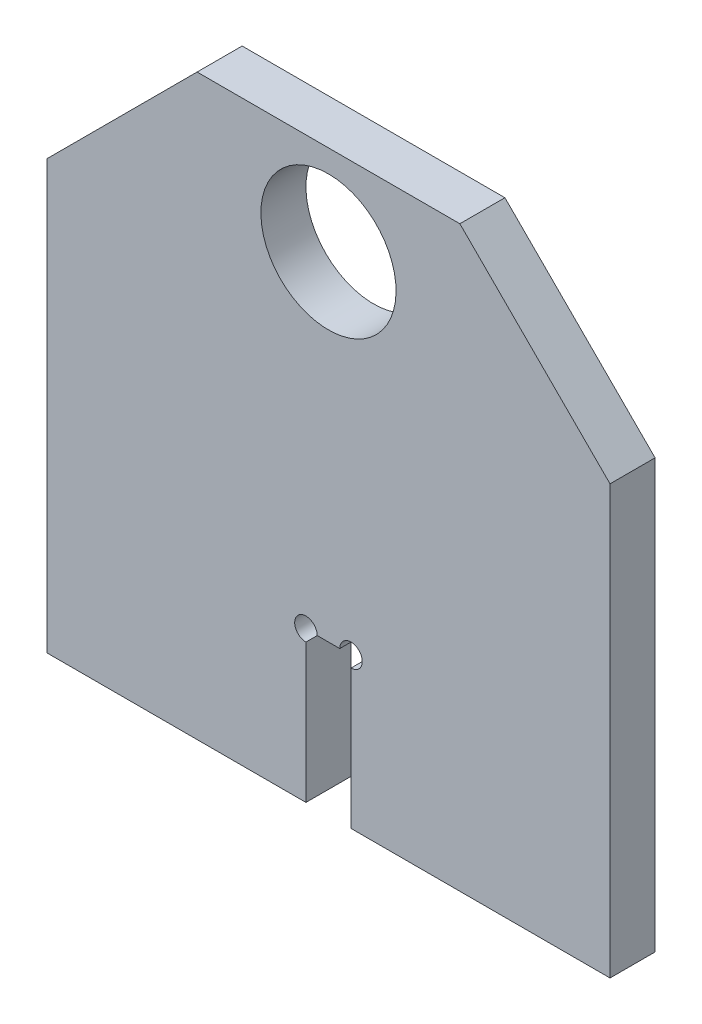
ISO-10303-21;
HEADER;
FILE_DESCRIPTION(('STEP AP214'),'2;1');
FILE_NAME('part.step','',(''),(''),'','','');
FILE_SCHEMA(('AUTOMOTIVE_DESIGN { 1 0 10303 214 1 1 1 1 }'));
ENDSEC;
DATA;
#1=APPLICATION_CONTEXT('core data for automotive mechanical design processes');
#2=APPLICATION_PROTOCOL_DEFINITION('international standard','automotive_design',2000,#1);
#3=PRODUCT_CONTEXT('',#1,'mechanical');
#4=PRODUCT('Part','Part','',(#3));
#5=PRODUCT_RELATED_PRODUCT_CATEGORY('part','',(#4));
#6=PRODUCT_DEFINITION_FORMATION('','',#4);
#7=PRODUCT_DEFINITION_CONTEXT('part definition',#1,'design');
#8=PRODUCT_DEFINITION('design','',#6,#7);
#9=PRODUCT_DEFINITION_SHAPE('','',#8);
#10=(LENGTH_UNIT() NAMED_UNIT(*) SI_UNIT(.MILLI.,.METRE.));
#11=(NAMED_UNIT(*) PLANE_ANGLE_UNIT() SI_UNIT($,.RADIAN.));
#12=(NAMED_UNIT(*) SI_UNIT($,.STERADIAN.) SOLID_ANGLE_UNIT());
#13=UNCERTAINTY_MEASURE_WITH_UNIT(LENGTH_MEASURE(1.E-05),#10,'distance_accuracy_value','');
#14=(GEOMETRIC_REPRESENTATION_CONTEXT(3) GLOBAL_UNCERTAINTY_ASSIGNED_CONTEXT((#13)) GLOBAL_UNIT_ASSIGNED_CONTEXT((#10,
#11,#12)) REPRESENTATION_CONTEXT('',''));
#15=CARTESIAN_POINT('',(0.,0.,0.));
#16=DIRECTION('',(0.,0.,1.));
#17=DIRECTION('',(1.,0.,0.));
#18=AXIS2_PLACEMENT_3D('',#15,#16,#17);
#19=CARTESIAN_POINT('',(3.00000000000011,120.,113.489534374282));
#20=DIRECTION('',(0.,0.,-1.));
#21=DIRECTION('',(-1.,0.,0.));
#22=AXIS2_PLACEMENT_3D('',#19,#20,#21);
#23=CYLINDRICAL_SURFACE('',#22,1.5);
#24=CARTESIAN_POINT('',(3.00000000000011,120.,6.00000000000001));
#25=DIRECTION('',(0.,0.,-1.));
#26=DIRECTION('',(0.,1.,0.));
#27=AXIS2_PLACEMENT_3D('',#24,#25,#26);
#28=CIRCLE('',#27,1.5);
#29=CARTESIAN_POINT('',(1.50000000000011,120.,6.00000000000001));
#30=VERTEX_POINT('',#29);
#31=CARTESIAN_POINT('',(3.00000000000013,118.5,6.00000000000001));
#32=VERTEX_POINT('',#31);
#33=EDGE_CURVE('E188',#30,#32,#28,.T.);
#34=ORIENTED_EDGE('',*,*,#33,.F.);
#35=DIRECTION('',(0.,0.,-1.));
#36=VECTOR('',#35,1.);
#37=CARTESIAN_POINT('',(1.50000000000011,120.,113.489534374282));
#38=LINE('',#37,#36);
#39=CARTESIAN_POINT('',(1.50000000000011,120.,0.));
#40=VERTEX_POINT('',#39);
#41=EDGE_CURVE('E145',#30,#40,#38,.T.);
#42=ORIENTED_EDGE('',*,*,#41,.T.);
#43=CARTESIAN_POINT('',(3.00000000000011,120.,0.));
#44=DIRECTION('',(0.,0.,1.));
#45=DIRECTION('',(1.,0.,0.));
#46=AXIS2_PLACEMENT_3D('',#43,#44,#45);
#47=CIRCLE('',#46,1.5);
#48=CARTESIAN_POINT('',(3.00000000000013,118.5,0.));
#49=VERTEX_POINT('',#48);
#50=EDGE_CURVE('E139',#49,#40,#47,.T.);
#51=ORIENTED_EDGE('',*,*,#50,.F.);
#52=DIRECTION('',(0.,0.,-1.));
#53=VECTOR('',#52,1.);
#54=CARTESIAN_POINT('',(3.00000000000013,118.5,113.489534374282));
#55=LINE('',#54,#53);
#56=EDGE_CURVE('E125',#32,#49,#55,.T.);
#57=ORIENTED_EDGE('',*,*,#56,.F.);
#58=EDGE_LOOP('',(#34,#42,#51,#57));
#59=FACE_BOUND('',#58,.T.);
#60=ADVANCED_FACE('F34',(#59),#23,.F.);
#61=CARTESIAN_POINT('',(3.00000000000165,0.,113.489534374282));
#62=DIRECTION('',(1.,0.,0.));
#63=DIRECTION('',(0.,1.,0.));
#64=AXIS2_PLACEMENT_3D('',#61,#62,#63);
#65=PLANE('',#64);
#66=DIRECTION('',(0.,0.,-1.));
#67=VECTOR('',#66,1.);
#68=CARTESIAN_POINT('',(3.00000000000037,99.9999999999999,113.489534374282));
#69=LINE('',#68,#67);
#70=CARTESIAN_POINT('',(3.00000000000037,99.9999999999999,6.00000000000001));
#71=VERTEX_POINT('',#70);
#72=CARTESIAN_POINT('',(3.00000000000037,99.9999999999999,0.));
#73=VERTEX_POINT('',#72);
#74=EDGE_CURVE('E119',#71,#73,#69,.T.);
#75=ORIENTED_EDGE('',*,*,#74,.F.);
#76=DIRECTION('',(0.,1.,0.));
#77=VECTOR('',#76,1.);
#78=CARTESIAN_POINT('',(3.00000000000165,0.,5.99999999999999));
#79=LINE('',#78,#77);
#80=EDGE_CURVE('E130',#71,#32,#79,.T.);
#81=ORIENTED_EDGE('',*,*,#80,.T.);
#82=ORIENTED_EDGE('',*,*,#56,.T.);
#83=DIRECTION('',(0.,-1.,0.));
#84=VECTOR('',#83,1.);
#85=CARTESIAN_POINT('',(3.00000000000165,0.,0.));
#86=LINE('',#85,#84);
#87=EDGE_CURVE('E128',#49,#73,#86,.T.);
#88=ORIENTED_EDGE('',*,*,#87,.T.);
#89=EDGE_LOOP('',(#75,#81,#82,#88));
#90=FACE_BOUND('',#89,.T.);
#91=ADVANCED_FACE('F127',(#90),#65,.F.);
#92=CARTESIAN_POINT('',(0.,99.9999999999999,113.489534374282));
#93=DIRECTION('',(0.,1.,0.));
#94=DIRECTION('',(-1.,0.,0.));
#95=AXIS2_PLACEMENT_3D('',#92,#93,#94);
#96=PLANE('',#95);
#97=DIRECTION('',(0.,0.,-1.));
#98=VECTOR('',#97,1.);
#99=CARTESIAN_POINT('',(37.5,100.,113.489534374282));
#100=LINE('',#99,#98);
#101=CARTESIAN_POINT('',(37.5,100.,6.));
#102=VERTEX_POINT('',#101);
#103=CARTESIAN_POINT('',(37.5,100.,0.));
#104=VERTEX_POINT('',#103);
#105=EDGE_CURVE('E158',#102,#104,#100,.T.);
#106=ORIENTED_EDGE('',*,*,#105,.F.);
#107=DIRECTION('',(-1.,0.,0.));
#108=VECTOR('',#107,1.);
#109=CARTESIAN_POINT('',(0.,99.9999999999999,6.00000000000001));
#110=LINE('',#109,#108);
#111=EDGE_CURVE('E142',#102,#71,#110,.T.);
#112=ORIENTED_EDGE('',*,*,#111,.T.);
#113=ORIENTED_EDGE('',*,*,#74,.T.);
#114=DIRECTION('',(1.,0.,0.));
#115=VECTOR('',#114,1.);
#116=CARTESIAN_POINT('',(0.,99.9999999999999,0.));
#117=LINE('',#116,#115);
#118=EDGE_CURVE('E141',#73,#104,#117,.T.);
#119=ORIENTED_EDGE('',*,*,#118,.T.);
#120=EDGE_LOOP('',(#106,#112,#113,#119));
#121=FACE_BOUND('',#120,.T.);
#122=ADVANCED_FACE('F235',(#121),#96,.F.);
#123=CARTESIAN_POINT('',(37.4999999999998,0.,113.489534374282));
#124=DIRECTION('',(-1.,0.,0.));
#125=DIRECTION('',(0.,-1.,0.));
#126=AXIS2_PLACEMENT_3D('',#123,#124,#125);
#127=PLANE('',#126);
#128=DIRECTION('',(0.,0.,-1.));
#129=VECTOR('',#128,1.);
#130=CARTESIAN_POINT('',(37.5000000000001,157.,113.489534374282));
#131=LINE('',#130,#129);
#132=CARTESIAN_POINT('',(37.5000000000001,157.,6.00000000000002));
#133=VERTEX_POINT('',#132);
#134=CARTESIAN_POINT('',(37.5000000000001,157.,0.));
#135=VERTEX_POINT('',#134);
#136=EDGE_CURVE('E162',#133,#135,#131,.T.);
#137=ORIENTED_EDGE('',*,*,#136,.F.);
#138=DIRECTION('',(0.,-1.,0.));
#139=VECTOR('',#138,1.);
#140=CARTESIAN_POINT('',(37.4999999999998,0.,5.99999999999999));
#141=LINE('',#140,#139);
#142=EDGE_CURVE('E161',#133,#102,#141,.T.);
#143=ORIENTED_EDGE('',*,*,#142,.T.);
#144=ORIENTED_EDGE('',*,*,#105,.T.);
#145=DIRECTION('',(0.,1.,0.));
#146=VECTOR('',#145,1.);
#147=CARTESIAN_POINT('',(37.4999999999998,0.,0.));
#148=LINE('',#147,#146);
#149=EDGE_CURVE('E160',#104,#135,#148,.T.);
#150=ORIENTED_EDGE('',*,*,#149,.T.);
#151=EDGE_LOOP('',(#137,#143,#144,#150));
#152=FACE_BOUND('',#151,.T.);
#153=ADVANCED_FACE('F240',(#152),#127,.F.);
#154=CARTESIAN_POINT('',(97.25,97.2500000000001,113.489534374282));
#155=DIRECTION('',(-0.707106781186547,-0.707106781186548,0.));
#156=DIRECTION('',(0.707106781186548,-0.707106781186547,0.));
#157=AXIS2_PLACEMENT_3D('',#154,#155,#156);
#158=PLANE('',#157);
#159=DIRECTION('',(0.,0.,-1.));
#160=VECTOR('',#159,1.);
#161=CARTESIAN_POINT('',(17.5000000000001,177.,113.489534374282));
#162=LINE('',#161,#160);
#163=CARTESIAN_POINT('',(17.5000000000001,177.,6.00000000000002));
#164=VERTEX_POINT('',#163);
#165=CARTESIAN_POINT('',(17.5000000000001,177.,0.));
#166=VERTEX_POINT('',#165);
#167=EDGE_CURVE('E166',#164,#166,#162,.T.);
#168=ORIENTED_EDGE('',*,*,#167,.F.);
#169=DIRECTION('',(0.707106781186548,-0.707106781186547,0.));
#170=VECTOR('',#169,1.);
#171=CARTESIAN_POINT('',(97.25,97.2500000000001,6.00000000000002));
#172=LINE('',#171,#170);
#173=EDGE_CURVE('E165',#164,#133,#172,.T.);
#174=ORIENTED_EDGE('',*,*,#173,.T.);
#175=ORIENTED_EDGE('',*,*,#136,.T.);
#176=DIRECTION('',(-0.707106781186548,0.707106781186547,0.));
#177=VECTOR('',#176,1.);
#178=CARTESIAN_POINT('',(97.25,97.2500000000001,0.));
#179=LINE('',#178,#177);
#180=EDGE_CURVE('E164',#135,#166,#179,.T.);
#181=ORIENTED_EDGE('',*,*,#180,.T.);
#182=EDGE_LOOP('',(#168,#174,#175,#181));
#183=FACE_BOUND('',#182,.T.);
#184=ADVANCED_FACE('F245',(#183),#158,.F.);
#185=CARTESIAN_POINT('',(0.,177.,113.489534374282));
#186=DIRECTION('',(0.,-1.,0.));
#187=DIRECTION('',(0.,0.,-1.));
#188=AXIS2_PLACEMENT_3D('',#185,#186,#187);
#189=PLANE('',#188);
#190=DIRECTION('',(0.,0.,-1.));
#191=VECTOR('',#190,1.);
#192=CARTESIAN_POINT('',(-17.4999999999999,177.,113.489534374282));
#193=LINE('',#192,#191);
#194=CARTESIAN_POINT('',(-17.4999999999999,177.,6.00000000000001));
#195=VERTEX_POINT('',#194);
#196=CARTESIAN_POINT('',(-17.4999999999999,177.,0.));
#197=VERTEX_POINT('',#196);
#198=EDGE_CURVE('E170',#195,#197,#193,.T.);
#199=ORIENTED_EDGE('',*,*,#198,.F.);
#200=DIRECTION('',(1.,0.,0.));
#201=VECTOR('',#200,1.);
#202=CARTESIAN_POINT('',(0.,177.,6.00000000000002));
#203=LINE('',#202,#201);
#204=EDGE_CURVE('E169',#195,#164,#203,.T.);
#205=ORIENTED_EDGE('',*,*,#204,.T.);
#206=ORIENTED_EDGE('',*,*,#167,.T.);
#207=DIRECTION('',(-1.,0.,0.));
#208=VECTOR('',#207,1.);
#209=CARTESIAN_POINT('',(0.,177.,0.));
#210=LINE('',#209,#208);
#211=EDGE_CURVE('E168',#166,#197,#210,.T.);
#212=ORIENTED_EDGE('',*,*,#211,.T.);
#213=EDGE_LOOP('',(#199,#205,#206,#212));
#214=FACE_BOUND('',#213,.T.);
#215=ADVANCED_FACE('F247',(#214),#189,.F.);
#216=CARTESIAN_POINT('',(-97.2499999999999,97.2499999999999,113.489534374282));
#217=DIRECTION('',(0.707106781186548,-0.707106781186548,0.));
#218=DIRECTION('',(0.707106781186548,0.707106781186548,0.));
#219=AXIS2_PLACEMENT_3D('',#216,#217,#218);
#220=PLANE('',#219);
#221=DIRECTION('',(0.,0.,-1.));
#222=VECTOR('',#221,1.);
#223=CARTESIAN_POINT('',(-37.4999999999999,157.,113.489534374282));
#224=LINE('',#223,#222);
#225=CARTESIAN_POINT('',(-37.4999999999999,157.,6.00000000000001));
#226=VERTEX_POINT('',#225);
#227=CARTESIAN_POINT('',(-37.4999999999999,157.,0.));
#228=VERTEX_POINT('',#227);
#229=EDGE_CURVE('E174',#226,#228,#224,.T.);
#230=ORIENTED_EDGE('',*,*,#229,.F.);
#231=DIRECTION('',(0.707106781186548,0.707106781186548,0.));
#232=VECTOR('',#231,1.);
#233=CARTESIAN_POINT('',(-97.2499999999999,97.2499999999999,5.99999999999999));
#234=LINE('',#233,#232);
#235=EDGE_CURVE('E173',#226,#195,#234,.T.);
#236=ORIENTED_EDGE('',*,*,#235,.T.);
#237=ORIENTED_EDGE('',*,*,#198,.T.);
#238=DIRECTION('',(-0.707106781186548,-0.707106781186548,0.));
#239=VECTOR('',#238,1.);
#240=CARTESIAN_POINT('',(-97.2499999999999,97.2499999999999,0.));
#241=LINE('',#240,#239);
#242=EDGE_CURVE('E172',#197,#228,#241,.T.);
#243=ORIENTED_EDGE('',*,*,#242,.T.);
#244=EDGE_LOOP('',(#230,#236,#237,#243));
#245=FACE_BOUND('',#244,.T.);
#246=ADVANCED_FACE('F251',(#245),#220,.F.);
#247=CARTESIAN_POINT('',(-37.5000000000002,0.,113.489534374282));
#248=DIRECTION('',(-1.,0.,0.));
#249=DIRECTION('',(0.,-1.,0.));
#250=AXIS2_PLACEMENT_3D('',#247,#248,#249);
#251=PLANE('',#250);
#252=DIRECTION('',(0.,-1.,0.));
#253=VECTOR('',#252,1.);
#254=CARTESIAN_POINT('',(-37.5000000000002,0.,5.99999999999999));
#255=LINE('',#254,#253);
#256=CARTESIAN_POINT('',(-37.5,99.9999999999999,6.));
#257=VERTEX_POINT('',#256);
#258=EDGE_CURVE('E190',#226,#257,#255,.T.);
#259=ORIENTED_EDGE('',*,*,#258,.F.);
#260=ORIENTED_EDGE('',*,*,#229,.T.);
#261=DIRECTION('',(0.,1.,0.));
#262=VECTOR('',#261,1.);
#263=CARTESIAN_POINT('',(-37.5000000000002,0.,0.));
#264=LINE('',#263,#262);
#265=CARTESIAN_POINT('',(-37.5,99.9999999999999,0.));
#266=VERTEX_POINT('',#265);
#267=EDGE_CURVE('E151',#266,#228,#264,.T.);
#268=ORIENTED_EDGE('',*,*,#267,.F.);
#269=DIRECTION('',(0.,0.,-1.));
#270=VECTOR('',#269,1.);
#271=CARTESIAN_POINT('',(-37.5,99.9999999999999,113.489534374282));
#272=LINE('',#271,#270);
#273=EDGE_CURVE('E177',#257,#266,#272,.T.);
#274=ORIENTED_EDGE('',*,*,#273,.F.);
#275=EDGE_LOOP('',(#259,#260,#268,#274));
#276=FACE_BOUND('',#275,.T.);
#277=ADVANCED_FACE('F256',(#276),#251,.T.);
#278=CARTESIAN_POINT('',(0.,99.9999999999999,113.489534374282));
#279=DIRECTION('',(0.,1.,0.));
#280=DIRECTION('',(0.,0.,1.));
#281=AXIS2_PLACEMENT_3D('',#278,#279,#280);
#282=PLANE('',#281);
#283=DIRECTION('',(0.,0.,-1.));
#284=VECTOR('',#283,1.);
#285=CARTESIAN_POINT('',(-3.00000000000035,99.9999999999999,113.489534374282));
#286=LINE('',#285,#284);
#287=CARTESIAN_POINT('',(-3.00000000000035,99.9999999999999,6.));
#288=VERTEX_POINT('',#287);
#289=CARTESIAN_POINT('',(-3.00000000000035,99.9999999999999,0.));
#290=VERTEX_POINT('',#289);
#291=EDGE_CURVE('E180',#288,#290,#286,.T.);
#292=ORIENTED_EDGE('',*,*,#291,.F.);
#293=DIRECTION('',(-1.,0.,0.));
#294=VECTOR('',#293,1.);
#295=CARTESIAN_POINT('',(0.,99.9999999999999,6.00000000000001));
#296=LINE('',#295,#294);
#297=EDGE_CURVE('E176',#288,#257,#296,.T.);
#298=ORIENTED_EDGE('',*,*,#297,.T.);
#299=ORIENTED_EDGE('',*,*,#273,.T.);
#300=DIRECTION('',(1.,0.,0.));
#301=VECTOR('',#300,1.);
#302=CARTESIAN_POINT('',(0.,99.9999999999999,0.));
#303=LINE('',#302,#301);
#304=EDGE_CURVE('E179',#266,#290,#303,.T.);
#305=ORIENTED_EDGE('',*,*,#304,.T.);
#306=EDGE_LOOP('',(#292,#298,#299,#305));
#307=FACE_BOUND('',#306,.T.);
#308=ADVANCED_FACE('F258',(#307),#282,.F.);
#309=CARTESIAN_POINT('',(-3.00000000000115,0.,113.489534374282));
#310=DIRECTION('',(-1.,0.,0.));
#311=DIRECTION('',(0.,-1.,0.));
#312=AXIS2_PLACEMENT_3D('',#309,#310,#311);
#313=PLANE('',#312);
#314=DIRECTION('',(0.,0.,-1.));
#315=VECTOR('',#314,1.);
#316=CARTESIAN_POINT('',(-3.0000000000002,118.5,113.489534374282));
#317=LINE('',#316,#315);
#318=CARTESIAN_POINT('',(-3.0000000000002,118.5,6.00000000000001));
#319=VERTEX_POINT('',#318);
#320=CARTESIAN_POINT('',(-3.0000000000002,118.5,0.));
#321=VERTEX_POINT('',#320);
#322=EDGE_CURVE('E184',#319,#321,#317,.T.);
#323=ORIENTED_EDGE('',*,*,#322,.F.);
#324=DIRECTION('',(0.,-1.,0.));
#325=VECTOR('',#324,1.);
#326=CARTESIAN_POINT('',(-3.00000000000115,0.,5.99999999999999));
#327=LINE('',#326,#325);
#328=EDGE_CURVE('E183',#319,#288,#327,.T.);
#329=ORIENTED_EDGE('',*,*,#328,.T.);
#330=ORIENTED_EDGE('',*,*,#291,.T.);
#331=DIRECTION('',(0.,1.,0.));
#332=VECTOR('',#331,1.);
#333=CARTESIAN_POINT('',(-3.00000000000115,0.,0.));
#334=LINE('',#333,#332);
#335=EDGE_CURVE('E182',#290,#321,#334,.T.);
#336=ORIENTED_EDGE('',*,*,#335,.T.);
#337=EDGE_LOOP('',(#323,#329,#330,#336));
#338=FACE_BOUND('',#337,.T.);
#339=ADVANCED_FACE('F218',(#338),#313,.F.);
#340=CARTESIAN_POINT('',(-3.00000000000018,120.,113.489534374282));
#341=DIRECTION('',(0.,0.,-1.));
#342=DIRECTION('',(-1.,0.,0.));
#343=AXIS2_PLACEMENT_3D('',#340,#341,#342);
#344=CYLINDRICAL_SURFACE('',#343,1.5);
#345=CARTESIAN_POINT('',(-3.00000000000018,120.,6.00000000000001));
#346=DIRECTION('',(0.,0.,-1.));
#347=DIRECTION('',(0.,1.,0.));
#348=AXIS2_PLACEMENT_3D('',#345,#346,#347);
#349=CIRCLE('',#348,1.5);
#350=CARTESIAN_POINT('',(-1.50000000000018,120.,6.00000000000003));
#351=VERTEX_POINT('',#350);
#352=EDGE_CURVE('E43',#319,#351,#349,.T.);
#353=ORIENTED_EDGE('',*,*,#352,.F.);
#354=ORIENTED_EDGE('',*,*,#322,.T.);
#355=CARTESIAN_POINT('',(-3.00000000000018,120.,0.));
#356=DIRECTION('',(0.,0.,1.));
#357=DIRECTION('',(1.,0.,0.));
#358=AXIS2_PLACEMENT_3D('',#355,#356,#357);
#359=CIRCLE('',#358,1.5);
#360=CARTESIAN_POINT('',(-1.50000000000018,120.,0.));
#361=VERTEX_POINT('',#360);
#362=EDGE_CURVE('E147',#361,#321,#359,.T.);
#363=ORIENTED_EDGE('',*,*,#362,.F.);
#364=DIRECTION('',(0.,0.,-1.));
#365=VECTOR('',#364,1.);
#366=CARTESIAN_POINT('',(-1.50000000000018,120.,113.489534374282));
#367=LINE('',#366,#365);
#368=EDGE_CURVE('E153',#351,#361,#367,.T.);
#369=ORIENTED_EDGE('',*,*,#368,.F.);
#370=EDGE_LOOP('',(#353,#354,#363,#369));
#371=FACE_BOUND('',#370,.T.);
#372=ADVANCED_FACE('F214',(#371),#344,.F.);
#373=CARTESIAN_POINT('',(0.,120.,113.489534374282));
#374=DIRECTION('',(0.,1.,0.));
#375=DIRECTION('',(0.,0.,1.));
#376=AXIS2_PLACEMENT_3D('',#373,#374,#375);
#377=PLANE('',#376);
#378=ORIENTED_EDGE('',*,*,#41,.F.);
#379=DIRECTION('',(-1.,0.,0.));
#380=VECTOR('',#379,1.);
#381=CARTESIAN_POINT('',(0.,120.,6.00000000000001));
#382=LINE('',#381,#380);
#383=EDGE_CURVE('E51',#30,#351,#382,.T.);
#384=ORIENTED_EDGE('',*,*,#383,.T.);
#385=ORIENTED_EDGE('',*,*,#368,.T.);
#386=DIRECTION('',(1.,0.,0.));
#387=VECTOR('',#386,1.);
#388=CARTESIAN_POINT('',(0.,120.,0.));
#389=LINE('',#388,#387);
#390=EDGE_CURVE('E148',#361,#40,#389,.T.);
#391=ORIENTED_EDGE('',*,*,#390,.T.);
#392=EDGE_LOOP('',(#378,#384,#385,#391));
#393=FACE_BOUND('',#392,.T.);
#394=ADVANCED_FACE('F208',(#393),#377,.F.);
#395=CARTESIAN_POINT('',(8.64893787659278E-05,165.,113.489534374282));
#396=DIRECTION('',(0.,0.,-1.));
#397=DIRECTION('',(-1.,0.,0.));
#398=AXIS2_PLACEMENT_3D('',#395,#396,#397);
#399=CYLINDRICAL_SURFACE('',#398,9.);
#400=CARTESIAN_POINT('',(8.64893787659278E-05,165.,6.00000000000002));
#401=DIRECTION('',(0.,0.,-1.));
#402=DIRECTION('',(0.,1.,0.));
#403=AXIS2_PLACEMENT_3D('',#400,#401,#402);
#404=CIRCLE('',#403,9.);
#405=CARTESIAN_POINT('',(8.64893787659278E-05,174.,6.00000000000002));
#406=VERTEX_POINT('',#405);
#407=EDGE_CURVE('E11',#406,#406,#404,.T.);
#408=ORIENTED_EDGE('',*,*,#407,.F.);
#409=EDGE_LOOP('',(#408));
#410=FACE_BOUND('',#409,.T.);
#411=CARTESIAN_POINT('',(8.64893787659278E-05,165.,0.));
#412=DIRECTION('',(0.,0.,1.));
#413=DIRECTION('',(1.,0.,0.));
#414=AXIS2_PLACEMENT_3D('',#411,#412,#413);
#415=CIRCLE('',#414,9.);
#416=CARTESIAN_POINT('',(9.00008648937877,165.,0.));
#417=VERTEX_POINT('',#416);
#418=EDGE_CURVE('E191',#417,#417,#415,.T.);
#419=ORIENTED_EDGE('',*,*,#418,.F.);
#420=EDGE_LOOP('',(#419));
#421=FACE_BOUND('',#420,.T.);
#422=ADVANCED_FACE('F274',(#410,#421),#399,.F.);
#423=CARTESIAN_POINT('',(0.,0.,0.));
#424=DIRECTION('',(0.,0.,1.));
#425=DIRECTION('',(1.,0.,0.));
#426=AXIS2_PLACEMENT_3D('',#423,#424,#425);
#427=PLANE('',#426);
#428=ORIENTED_EDGE('',*,*,#50,.T.);
#429=ORIENTED_EDGE('',*,*,#390,.F.);
#430=ORIENTED_EDGE('',*,*,#362,.T.);
#431=ORIENTED_EDGE('',*,*,#335,.F.);
#432=ORIENTED_EDGE('',*,*,#304,.F.);
#433=ORIENTED_EDGE('',*,*,#267,.T.);
#434=ORIENTED_EDGE('',*,*,#242,.F.);
#435=ORIENTED_EDGE('',*,*,#211,.F.);
#436=ORIENTED_EDGE('',*,*,#180,.F.);
#437=ORIENTED_EDGE('',*,*,#149,.F.);
#438=ORIENTED_EDGE('',*,*,#118,.F.);
#439=ORIENTED_EDGE('',*,*,#87,.F.);
#440=EDGE_LOOP('',(#428,#429,#430,#431,#432,#433,#434,#435,#436,#437,#438,#439));
#441=FACE_BOUND('',#440,.T.);
#442=ORIENTED_EDGE('',*,*,#418,.T.);
#443=EDGE_LOOP('',(#442));
#444=FACE_BOUND('',#443,.T.);
#445=ADVANCED_FACE('F136',(#441,#444),#427,.F.);
#446=CARTESIAN_POINT('',(-883.88347648318,-1.09029007567318E-13,5.99999999999989));
#447=DIRECTION('',(0.,0.,-1.));
#448=DIRECTION('',(-1.,0.,0.));
#449=AXIS2_PLACEMENT_3D('',#446,#447,#448);
#450=PLANE('',#449);
#451=ORIENTED_EDGE('',*,*,#33,.T.);
#452=ORIENTED_EDGE('',*,*,#80,.F.);
#453=ORIENTED_EDGE('',*,*,#111,.F.);
#454=ORIENTED_EDGE('',*,*,#142,.F.);
#455=ORIENTED_EDGE('',*,*,#173,.F.);
#456=ORIENTED_EDGE('',*,*,#204,.F.);
#457=ORIENTED_EDGE('',*,*,#235,.F.);
#458=ORIENTED_EDGE('',*,*,#258,.T.);
#459=ORIENTED_EDGE('',*,*,#297,.F.);
#460=ORIENTED_EDGE('',*,*,#328,.F.);
#461=ORIENTED_EDGE('',*,*,#352,.T.);
#462=ORIENTED_EDGE('',*,*,#383,.F.);
#463=EDGE_LOOP('',(#451,#452,#453,#454,#455,#456,#457,#458,#459,#460,#461,#462));
#464=FACE_BOUND('',#463,.T.);
#465=ORIENTED_EDGE('',*,*,#407,.T.);
#466=EDGE_LOOP('',(#465));
#467=FACE_BOUND('',#466,.T.);
#468=ADVANCED_FACE('F36',(#464,#467),#450,.F.);
#469=CLOSED_SHELL('',(#60,#91,#122,#153,#184,#215,#246,#277,#308,#339,#372,#394,#422,#445,#468));
#470=MANIFOLD_SOLID_BREP('B2',#469);
#471=ADVANCED_BREP_SHAPE_REPRESENTATION('',(#18,#470),#14);
#472=SHAPE_DEFINITION_REPRESENTATION(#9,#471);
ENDSEC;
END-ISO-10303-21;
